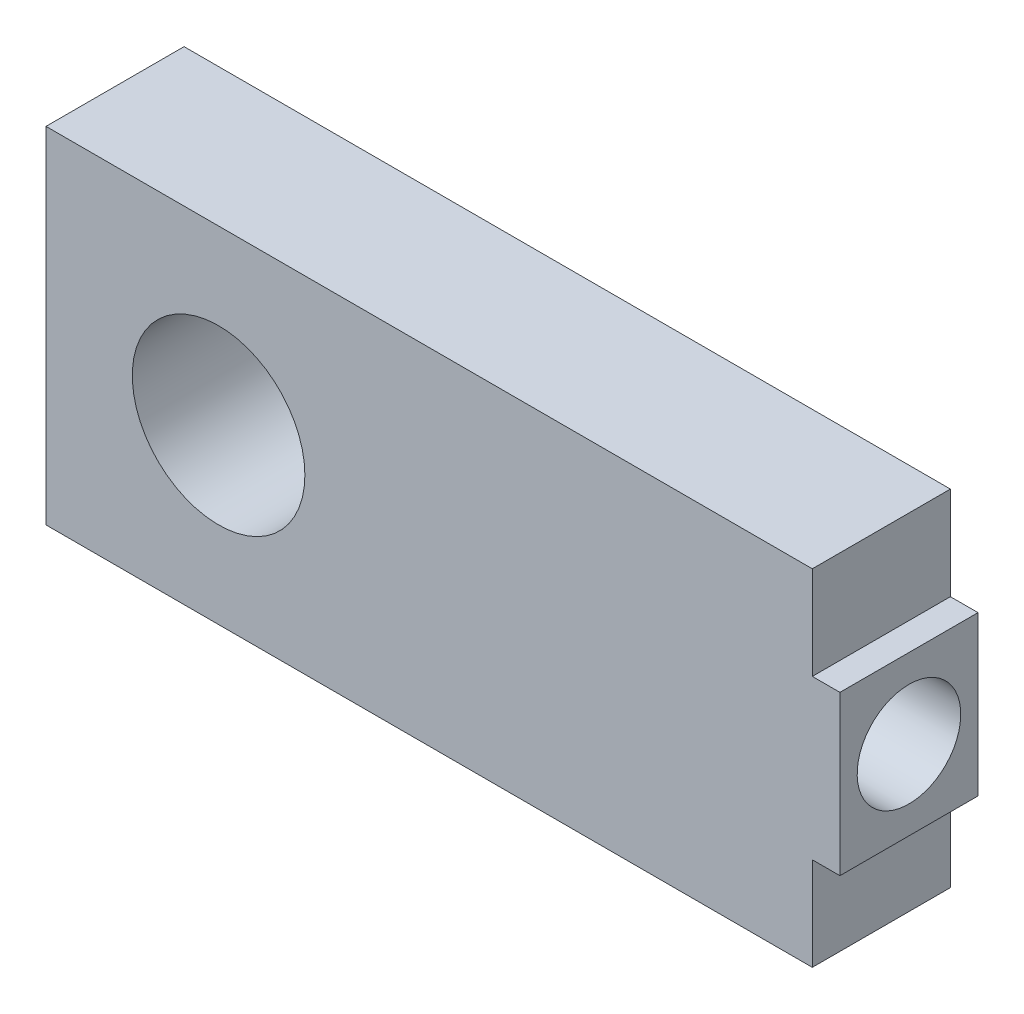
ISO-10303-21;
HEADER;
FILE_DESCRIPTION(('STEP AP214'),'2;1');
FILE_NAME('part.step','',(''),(''),'','','');
FILE_SCHEMA(('AUTOMOTIVE_DESIGN { 1 0 10303 214 1 1 1 1 }'));
ENDSEC;
DATA;
#1=APPLICATION_CONTEXT('core data for automotive mechanical design processes');
#2=APPLICATION_PROTOCOL_DEFINITION('international standard','automotive_design',2000,#1);
#3=PRODUCT_CONTEXT('',#1,'mechanical');
#4=PRODUCT('Part','Part','',(#3));
#5=PRODUCT_RELATED_PRODUCT_CATEGORY('part','',(#4));
#6=PRODUCT_DEFINITION_FORMATION('','',#4);
#7=PRODUCT_DEFINITION_CONTEXT('part definition',#1,'design');
#8=PRODUCT_DEFINITION('design','',#6,#7);
#9=PRODUCT_DEFINITION_SHAPE('','',#8);
#10=(LENGTH_UNIT() NAMED_UNIT(*) SI_UNIT(.MILLI.,.METRE.));
#11=(NAMED_UNIT(*) PLANE_ANGLE_UNIT() SI_UNIT($,.RADIAN.));
#12=(NAMED_UNIT(*) SI_UNIT($,.STERADIAN.) SOLID_ANGLE_UNIT());
#13=UNCERTAINTY_MEASURE_WITH_UNIT(LENGTH_MEASURE(1.E-05),#10,'distance_accuracy_value','');
#14=(GEOMETRIC_REPRESENTATION_CONTEXT(3) GLOBAL_UNCERTAINTY_ASSIGNED_CONTEXT((#13)) GLOBAL_UNIT_ASSIGNED_CONTEXT((#10,
#11,#12)) REPRESENTATION_CONTEXT('',''));
#15=CARTESIAN_POINT('',(0.,0.,0.));
#16=DIRECTION('',(0.,0.,1.));
#17=DIRECTION('',(1.,0.,0.));
#18=AXIS2_PLACEMENT_3D('',#15,#16,#17);
#19=CARTESIAN_POINT('',(0.,0.,508.));
#20=DIRECTION('',(0.,0.,-1.));
#21=DIRECTION('',(-1.,0.,0.));
#22=AXIS2_PLACEMENT_3D('',#19,#20,#21);
#23=PLANE('',#22);
#24=DIRECTION('',(0.,-1.,0.));
#25=VECTOR('',#24,1.);
#26=CARTESIAN_POINT('',(-2819.4,1270.,508.));
#27=LINE('',#26,#25);
#28=CARTESIAN_POINT('',(-2819.4,1270.,508.));
#29=VERTEX_POINT('',#28);
#30=CARTESIAN_POINT('',(-2819.4,-1270.,508.));
#31=VERTEX_POINT('',#30);
#32=EDGE_CURVE('E145',#29,#31,#27,.T.);
#33=ORIENTED_EDGE('',*,*,#32,.T.);
#34=DIRECTION('',(1.,0.,0.));
#35=VECTOR('',#34,1.);
#36=CARTESIAN_POINT('',(2819.4,-1270.,508.));
#37=LINE('',#36,#35);
#38=CARTESIAN_POINT('',(2819.4,-1270.,508.));
#39=VERTEX_POINT('',#38);
#40=EDGE_CURVE('E93',#31,#39,#37,.T.);
#41=ORIENTED_EDGE('',*,*,#40,.T.);
#42=DIRECTION('',(0.,1.,0.));
#43=VECTOR('',#42,1.);
#44=CARTESIAN_POINT('',(2819.4,-584.2,508.));
#45=LINE('',#44,#43);
#46=CARTESIAN_POINT('',(2819.4,-584.2,508.));
#47=VERTEX_POINT('',#46);
#48=EDGE_CURVE('E160',#39,#47,#45,.T.);
#49=ORIENTED_EDGE('',*,*,#48,.T.);
#50=DIRECTION('',(1.,0.,0.));
#51=VECTOR('',#50,1.);
#52=CARTESIAN_POINT('',(2819.4,-584.2,508.));
#53=LINE('',#52,#51);
#54=CARTESIAN_POINT('',(3022.6,-584.2,508.));
#55=VERTEX_POINT('',#54);
#56=EDGE_CURVE('E173',#47,#55,#53,.T.);
#57=ORIENTED_EDGE('',*,*,#56,.T.);
#58=DIRECTION('',(0.,1.,0.));
#59=VECTOR('',#58,1.);
#60=CARTESIAN_POINT('',(3022.6,584.2,508.));
#61=LINE('',#60,#59);
#62=CARTESIAN_POINT('',(3022.6,584.2,508.));
#63=VERTEX_POINT('',#62);
#64=EDGE_CURVE('E112',#55,#63,#61,.T.);
#65=ORIENTED_EDGE('',*,*,#64,.T.);
#66=DIRECTION('',(-1.,0.,0.));
#67=VECTOR('',#66,1.);
#68=CARTESIAN_POINT('',(2819.4,584.2,508.));
#69=LINE('',#68,#67);
#70=CARTESIAN_POINT('',(2819.4,584.2,508.));
#71=VERTEX_POINT('',#70);
#72=EDGE_CURVE('E106',#63,#71,#69,.T.);
#73=ORIENTED_EDGE('',*,*,#72,.T.);
#74=DIRECTION('',(0.,1.,0.));
#75=VECTOR('',#74,1.);
#76=CARTESIAN_POINT('',(2819.4,1270.,508.));
#77=LINE('',#76,#75);
#78=CARTESIAN_POINT('',(2819.4,1270.,508.));
#79=VERTEX_POINT('',#78);
#80=EDGE_CURVE('E110',#71,#79,#77,.T.);
#81=ORIENTED_EDGE('',*,*,#80,.T.);
#82=DIRECTION('',(-1.,0.,0.));
#83=VECTOR('',#82,1.);
#84=CARTESIAN_POINT('',(2819.4,1270.,508.));
#85=LINE('',#84,#83);
#86=EDGE_CURVE('E50',#79,#29,#85,.T.);
#87=ORIENTED_EDGE('',*,*,#86,.T.);
#88=EDGE_LOOP('',(#33,#41,#49,#57,#65,#73,#81,#87));
#89=FACE_BOUND('',#88,.T.);
#90=CARTESIAN_POINT('',(-1549.4,0.,508.));
#91=DIRECTION('',(0.,0.,1.));
#92=DIRECTION('',(1.,0.,0.));
#93=AXIS2_PLACEMENT_3D('',#90,#91,#92);
#94=CIRCLE('',#93,635.);
#95=CARTESIAN_POINT('',(-914.4,0.,508.));
#96=VERTEX_POINT('',#95);
#97=EDGE_CURVE('E134',#96,#96,#94,.T.);
#98=ORIENTED_EDGE('',*,*,#97,.F.);
#99=EDGE_LOOP('',(#98));
#100=FACE_BOUND('',#99,.T.);
#101=ADVANCED_FACE('F33',(#89,#100),#23,.F.);
#102=CARTESIAN_POINT('',(0.,0.,-508.));
#103=DIRECTION('',(0.,0.,-1.));
#104=DIRECTION('',(-1.,0.,0.));
#105=AXIS2_PLACEMENT_3D('',#102,#103,#104);
#106=PLANE('',#105);
#107=DIRECTION('',(0.,-1.,0.));
#108=VECTOR('',#107,1.);
#109=CARTESIAN_POINT('',(-2819.4,1270.,-508.));
#110=LINE('',#109,#108);
#111=CARTESIAN_POINT('',(-2819.4,1270.,-508.));
#112=VERTEX_POINT('',#111);
#113=CARTESIAN_POINT('',(-2819.4,-1270.,-508.));
#114=VERTEX_POINT('',#113);
#115=EDGE_CURVE('E130',#112,#114,#110,.T.);
#116=ORIENTED_EDGE('',*,*,#115,.F.);
#117=DIRECTION('',(-1.,0.,0.));
#118=VECTOR('',#117,1.);
#119=CARTESIAN_POINT('',(2819.4,1270.,-508.));
#120=LINE('',#119,#118);
#121=CARTESIAN_POINT('',(2819.4,1270.,-508.));
#122=VERTEX_POINT('',#121);
#123=EDGE_CURVE('E85',#122,#112,#120,.T.);
#124=ORIENTED_EDGE('',*,*,#123,.F.);
#125=DIRECTION('',(0.,1.,0.));
#126=VECTOR('',#125,1.);
#127=CARTESIAN_POINT('',(2819.4,1270.,-508.));
#128=LINE('',#127,#126);
#129=CARTESIAN_POINT('',(2819.4,584.2,-508.));
#130=VERTEX_POINT('',#129);
#131=EDGE_CURVE('E79',#130,#122,#128,.T.);
#132=ORIENTED_EDGE('',*,*,#131,.F.);
#133=DIRECTION('',(-1.,0.,0.));
#134=VECTOR('',#133,1.);
#135=CARTESIAN_POINT('',(2819.4,584.2,-508.));
#136=LINE('',#135,#134);
#137=CARTESIAN_POINT('',(3022.6,584.2,-508.));
#138=VERTEX_POINT('',#137);
#139=EDGE_CURVE('E120',#138,#130,#136,.T.);
#140=ORIENTED_EDGE('',*,*,#139,.F.);
#141=DIRECTION('',(0.,1.,0.));
#142=VECTOR('',#141,1.);
#143=CARTESIAN_POINT('',(3022.6,584.2,-508.));
#144=LINE('',#143,#142);
#145=CARTESIAN_POINT('',(3022.6,-584.2,-508.));
#146=VERTEX_POINT('',#145);
#147=EDGE_CURVE('E140',#146,#138,#144,.T.);
#148=ORIENTED_EDGE('',*,*,#147,.F.);
#149=DIRECTION('',(1.,0.,0.));
#150=VECTOR('',#149,1.);
#151=CARTESIAN_POINT('',(2819.4,-584.2,-508.));
#152=LINE('',#151,#150);
#153=CARTESIAN_POINT('',(2819.4,-584.2,-508.));
#154=VERTEX_POINT('',#153);
#155=EDGE_CURVE('E138',#154,#146,#152,.T.);
#156=ORIENTED_EDGE('',*,*,#155,.F.);
#157=DIRECTION('',(0.,1.,0.));
#158=VECTOR('',#157,1.);
#159=CARTESIAN_POINT('',(2819.4,-584.2,-508.));
#160=LINE('',#159,#158);
#161=CARTESIAN_POINT('',(2819.4,-1270.,-508.));
#162=VERTEX_POINT('',#161);
#163=EDGE_CURVE('E136',#162,#154,#160,.T.);
#164=ORIENTED_EDGE('',*,*,#163,.F.);
#165=DIRECTION('',(1.,0.,0.));
#166=VECTOR('',#165,1.);
#167=CARTESIAN_POINT('',(2819.4,-1270.,-508.));
#168=LINE('',#167,#166);
#169=EDGE_CURVE('E133',#114,#162,#168,.T.);
#170=ORIENTED_EDGE('',*,*,#169,.F.);
#171=EDGE_LOOP('',(#116,#124,#132,#140,#148,#156,#164,#170));
#172=FACE_BOUND('',#171,.T.);
#173=CARTESIAN_POINT('',(-1549.4,0.,-508.));
#174=DIRECTION('',(0.,0.,1.));
#175=DIRECTION('',(1.,0.,0.));
#176=AXIS2_PLACEMENT_3D('',#173,#174,#175);
#177=CIRCLE('',#176,635.);
#178=CARTESIAN_POINT('',(-914.4,0.,-508.));
#179=VERTEX_POINT('',#178);
#180=EDGE_CURVE('E179',#179,#179,#177,.T.);
#181=ORIENTED_EDGE('',*,*,#180,.T.);
#182=EDGE_LOOP('',(#181));
#183=FACE_BOUND('',#182,.T.);
#184=ADVANCED_FACE('F164',(#172,#183),#106,.T.);
#185=CARTESIAN_POINT('',(-2819.4,1270.,508.));
#186=DIRECTION('',(1.,0.,0.));
#187=DIRECTION('',(0.,1.,0.));
#188=AXIS2_PLACEMENT_3D('',#185,#186,#187);
#189=PLANE('',#188);
#190=ORIENTED_EDGE('',*,*,#115,.T.);
#191=DIRECTION('',(0.,0.,-1.));
#192=VECTOR('',#191,1.);
#193=CARTESIAN_POINT('',(-2819.4,-1270.,508.));
#194=LINE('',#193,#192);
#195=EDGE_CURVE('E11',#31,#114,#194,.T.);
#196=ORIENTED_EDGE('',*,*,#195,.F.);
#197=ORIENTED_EDGE('',*,*,#32,.F.);
#198=DIRECTION('',(0.,0.,-1.));
#199=VECTOR('',#198,1.);
#200=CARTESIAN_POINT('',(-2819.4,1270.,508.));
#201=LINE('',#200,#199);
#202=EDGE_CURVE('E126',#29,#112,#201,.T.);
#203=ORIENTED_EDGE('',*,*,#202,.T.);
#204=EDGE_LOOP('',(#190,#196,#197,#203));
#205=FACE_BOUND('',#204,.T.);
#206=ADVANCED_FACE('F35',(#205),#189,.F.);
#207=CARTESIAN_POINT('',(2819.4,-1270.,508.));
#208=DIRECTION('',(0.,1.,0.));
#209=DIRECTION('',(-1.,0.,0.));
#210=AXIS2_PLACEMENT_3D('',#207,#208,#209);
#211=PLANE('',#210);
#212=ORIENTED_EDGE('',*,*,#169,.T.);
#213=DIRECTION('',(0.,0.,-1.));
#214=VECTOR('',#213,1.);
#215=CARTESIAN_POINT('',(2819.4,-1270.,508.));
#216=LINE('',#215,#214);
#217=EDGE_CURVE('E42',#39,#162,#216,.T.);
#218=ORIENTED_EDGE('',*,*,#217,.F.);
#219=ORIENTED_EDGE('',*,*,#40,.F.);
#220=ORIENTED_EDGE('',*,*,#195,.T.);
#221=EDGE_LOOP('',(#212,#218,#219,#220));
#222=FACE_BOUND('',#221,.T.);
#223=ADVANCED_FACE('F275',(#222),#211,.F.);
#224=CARTESIAN_POINT('',(2819.4,-584.2,508.));
#225=DIRECTION('',(-1.,0.,0.));
#226=DIRECTION('',(0.,-1.,0.));
#227=AXIS2_PLACEMENT_3D('',#224,#225,#226);
#228=PLANE('',#227);
#229=ORIENTED_EDGE('',*,*,#163,.T.);
#230=DIRECTION('',(0.,0.,-1.));
#231=VECTOR('',#230,1.);
#232=CARTESIAN_POINT('',(2819.4,-584.2,508.));
#233=LINE('',#232,#231);
#234=EDGE_CURVE('E152',#47,#154,#233,.T.);
#235=ORIENTED_EDGE('',*,*,#234,.F.);
#236=ORIENTED_EDGE('',*,*,#48,.F.);
#237=ORIENTED_EDGE('',*,*,#217,.T.);
#238=EDGE_LOOP('',(#229,#235,#236,#237));
#239=FACE_BOUND('',#238,.T.);
#240=ADVANCED_FACE('F158',(#239),#228,.F.);
#241=CARTESIAN_POINT('',(2819.4,-584.2,508.));
#242=DIRECTION('',(0.,1.,0.));
#243=DIRECTION('',(0.,0.,1.));
#244=AXIS2_PLACEMENT_3D('',#241,#242,#243);
#245=PLANE('',#244);
#246=ORIENTED_EDGE('',*,*,#155,.T.);
#247=DIRECTION('',(0.,0.,-1.));
#248=VECTOR('',#247,1.);
#249=CARTESIAN_POINT('',(3022.6,-584.2,508.));
#250=LINE('',#249,#248);
#251=EDGE_CURVE('E149',#55,#146,#250,.T.);
#252=ORIENTED_EDGE('',*,*,#251,.F.);
#253=ORIENTED_EDGE('',*,*,#56,.F.);
#254=ORIENTED_EDGE('',*,*,#234,.T.);
#255=EDGE_LOOP('',(#246,#252,#253,#254));
#256=FACE_BOUND('',#255,.T.);
#257=ADVANCED_FACE('F169',(#256),#245,.F.);
#258=CARTESIAN_POINT('',(3022.6,584.2,508.));
#259=DIRECTION('',(-1.,0.,0.));
#260=DIRECTION('',(0.,-1.,0.));
#261=AXIS2_PLACEMENT_3D('',#258,#259,#260);
#262=PLANE('',#261);
#263=CARTESIAN_POINT('',(3022.6,-1.1488394776556E-12,0.));
#264=DIRECTION('',(1.,0.,0.));
#265=DIRECTION('',(0.,1.,0.));
#266=AXIS2_PLACEMENT_3D('',#263,#264,#265);
#267=CIRCLE('',#266,381.);
#268=CARTESIAN_POINT('',(3022.6,380.999999999999,0.));
#269=VERTEX_POINT('',#268);
#270=EDGE_CURVE('E185',#269,#269,#267,.T.);
#271=ORIENTED_EDGE('',*,*,#270,.F.);
#272=EDGE_LOOP('',(#271));
#273=FACE_BOUND('',#272,.T.);
#274=ORIENTED_EDGE('',*,*,#147,.T.);
#275=DIRECTION('',(0.,0.,-1.));
#276=VECTOR('',#275,1.);
#277=CARTESIAN_POINT('',(3022.6,584.2,508.));
#278=LINE('',#277,#276);
#279=EDGE_CURVE('E121',#63,#138,#278,.T.);
#280=ORIENTED_EDGE('',*,*,#279,.F.);
#281=ORIENTED_EDGE('',*,*,#64,.F.);
#282=ORIENTED_EDGE('',*,*,#251,.T.);
#283=EDGE_LOOP('',(#274,#280,#281,#282));
#284=FACE_BOUND('',#283,.T.);
#285=ADVANCED_FACE('F172',(#273,#284),#262,.F.);
#286=CARTESIAN_POINT('',(2819.4,584.2,508.));
#287=DIRECTION('',(0.,-1.,0.));
#288=DIRECTION('',(1.,0.,0.));
#289=AXIS2_PLACEMENT_3D('',#286,#287,#288);
#290=PLANE('',#289);
#291=ORIENTED_EDGE('',*,*,#139,.T.);
#292=DIRECTION('',(0.,0.,-1.));
#293=VECTOR('',#292,1.);
#294=CARTESIAN_POINT('',(2819.4,584.2,508.));
#295=LINE('',#294,#293);
#296=EDGE_CURVE('E117',#71,#130,#295,.T.);
#297=ORIENTED_EDGE('',*,*,#296,.F.);
#298=ORIENTED_EDGE('',*,*,#72,.F.);
#299=ORIENTED_EDGE('',*,*,#279,.T.);
#300=EDGE_LOOP('',(#291,#297,#298,#299));
#301=FACE_BOUND('',#300,.T.);
#302=ADVANCED_FACE('F118',(#301),#290,.F.);
#303=CARTESIAN_POINT('',(2819.4,1270.,508.));
#304=DIRECTION('',(-1.,0.,0.));
#305=DIRECTION('',(0.,-1.,0.));
#306=AXIS2_PLACEMENT_3D('',#303,#304,#305);
#307=PLANE('',#306);
#308=ORIENTED_EDGE('',*,*,#131,.T.);
#309=DIRECTION('',(0.,0.,-1.));
#310=VECTOR('',#309,1.);
#311=CARTESIAN_POINT('',(2819.4,1270.,508.));
#312=LINE('',#311,#310);
#313=EDGE_CURVE('E122',#79,#122,#312,.T.);
#314=ORIENTED_EDGE('',*,*,#313,.F.);
#315=ORIENTED_EDGE('',*,*,#80,.F.);
#316=ORIENTED_EDGE('',*,*,#296,.T.);
#317=EDGE_LOOP('',(#308,#314,#315,#316));
#318=FACE_BOUND('',#317,.T.);
#319=ADVANCED_FACE('F124',(#318),#307,.F.);
#320=CARTESIAN_POINT('',(2819.4,1270.,508.));
#321=DIRECTION('',(0.,-1.,0.));
#322=DIRECTION('',(1.,0.,0.));
#323=AXIS2_PLACEMENT_3D('',#320,#321,#322);
#324=PLANE('',#323);
#325=ORIENTED_EDGE('',*,*,#123,.T.);
#326=ORIENTED_EDGE('',*,*,#202,.F.);
#327=ORIENTED_EDGE('',*,*,#86,.F.);
#328=ORIENTED_EDGE('',*,*,#313,.T.);
#329=EDGE_LOOP('',(#325,#326,#327,#328));
#330=FACE_BOUND('',#329,.T.);
#331=ADVANCED_FACE('F216',(#330),#324,.F.);
#332=CARTESIAN_POINT('',(-1549.4,0.,508.));
#333=DIRECTION('',(0.,0.,-1.));
#334=DIRECTION('',(-1.,0.,0.));
#335=AXIS2_PLACEMENT_3D('',#332,#333,#334);
#336=CYLINDRICAL_SURFACE('',#335,635.);
#337=ORIENTED_EDGE('',*,*,#97,.T.);
#338=EDGE_LOOP('',(#337));
#339=FACE_BOUND('',#338,.T.);
#340=ORIENTED_EDGE('',*,*,#180,.F.);
#341=EDGE_LOOP('',(#340));
#342=FACE_BOUND('',#341,.T.);
#343=ADVANCED_FACE('F196',(#339,#342),#336,.F.);
#344=CARTESIAN_POINT('',(482.599999999999,-1.83428151894591E-13,0.));
#345=DIRECTION('',(1.,0.,0.));
#346=DIRECTION('',(0.,1.,0.));
#347=AXIS2_PLACEMENT_3D('',#344,#345,#346);
#348=CYLINDRICAL_SURFACE('',#347,381.);
#349=CARTESIAN_POINT('',(482.599999999999,-1.83428151894591E-13,0.));
#350=DIRECTION('',(1.,0.,0.));
#351=DIRECTION('',(0.,1.,0.));
#352=AXIS2_PLACEMENT_3D('',#349,#350,#351);
#353=CIRCLE('',#352,381.);
#354=CARTESIAN_POINT('',(482.599999999999,381.,0.));
#355=VERTEX_POINT('',#354);
#356=EDGE_CURVE('E182',#355,#355,#353,.T.);
#357=ORIENTED_EDGE('',*,*,#356,.F.);
#358=EDGE_LOOP('',(#357));
#359=FACE_BOUND('',#358,.T.);
#360=ORIENTED_EDGE('',*,*,#270,.T.);
#361=EDGE_LOOP('',(#360));
#362=FACE_BOUND('',#361,.T.);
#363=ADVANCED_FACE('F193',(#359,#362),#348,.F.);
#364=CARTESIAN_POINT('',(482.599999999999,-1.83428151894591E-13,0.));
#365=DIRECTION('',(1.,0.,0.));
#366=DIRECTION('',(0.,1.,0.));
#367=AXIS2_PLACEMENT_3D('',#364,#365,#366);
#368=PLANE('',#367);
#369=ORIENTED_EDGE('',*,*,#356,.T.);
#370=EDGE_LOOP('',(#369));
#371=FACE_BOUND('',#370,.T.);
#372=ADVANCED_FACE('F191',(#371),#368,.T.);
#373=CLOSED_SHELL('',(#101,#184,#206,#223,#240,#257,#285,#302,#319,#331,#343,#363,#372));
#374=MANIFOLD_SOLID_BREP('B2',#373);
#375=ADVANCED_BREP_SHAPE_REPRESENTATION('',(#18,#374),#14);
#376=SHAPE_DEFINITION_REPRESENTATION(#9,#375);
ENDSEC;
END-ISO-10303-21;
